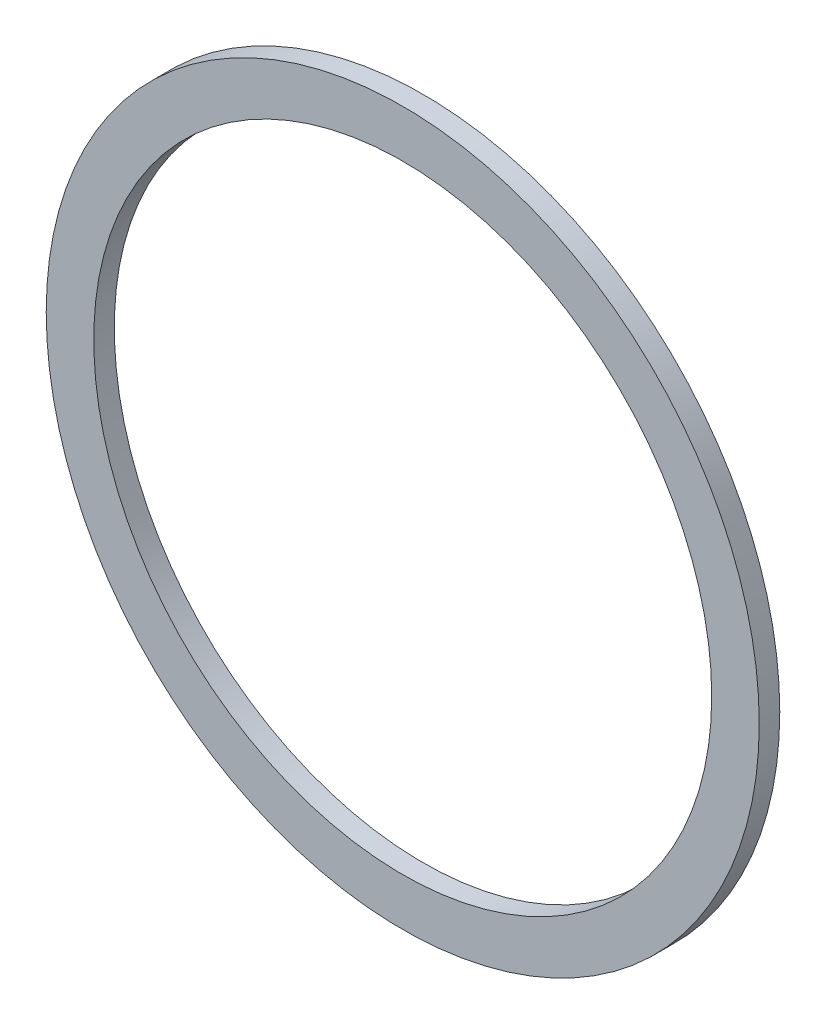
ISO-10303-21;
HEADER;
FILE_DESCRIPTION(('STEP AP214'),'2;1');
FILE_NAME('part.step','',(''),(''),'','','');
FILE_SCHEMA(('AUTOMOTIVE_DESIGN { 1 0 10303 214 1 1 1 1 }'));
ENDSEC;
DATA;
#1=APPLICATION_CONTEXT('core data for automotive mechanical design processes');
#2=APPLICATION_PROTOCOL_DEFINITION('international standard','automotive_design',2000,#1);
#3=PRODUCT_CONTEXT('',#1,'mechanical');
#4=PRODUCT('Part','Part','',(#3));
#5=PRODUCT_RELATED_PRODUCT_CATEGORY('part','',(#4));
#6=PRODUCT_DEFINITION_FORMATION('','',#4);
#7=PRODUCT_DEFINITION_CONTEXT('part definition',#1,'design');
#8=PRODUCT_DEFINITION('design','',#6,#7);
#9=PRODUCT_DEFINITION_SHAPE('','',#8);
#10=(LENGTH_UNIT() NAMED_UNIT(*) SI_UNIT(.MILLI.,.METRE.));
#11=(NAMED_UNIT(*) PLANE_ANGLE_UNIT() SI_UNIT($,.RADIAN.));
#12=(NAMED_UNIT(*) SI_UNIT($,.STERADIAN.) SOLID_ANGLE_UNIT());
#13=UNCERTAINTY_MEASURE_WITH_UNIT(LENGTH_MEASURE(1.E-05),#10,'distance_accuracy_value','');
#14=(GEOMETRIC_REPRESENTATION_CONTEXT(3) GLOBAL_UNCERTAINTY_ASSIGNED_CONTEXT((#13)) GLOBAL_UNIT_ASSIGNED_CONTEXT((#10,
#11,#12)) REPRESENTATION_CONTEXT('',''));
#15=CARTESIAN_POINT('',(0.,0.,0.));
#16=DIRECTION('',(0.,0.,1.));
#17=DIRECTION('',(1.,0.,0.));
#18=AXIS2_PLACEMENT_3D('',#15,#16,#17);
#19=CARTESIAN_POINT('',(0.,0.,4.318));
#20=DIRECTION('',(0.,0.,1.));
#21=DIRECTION('',(1.,0.,0.));
#22=AXIS2_PLACEMENT_3D('',#19,#20,#21);
#23=PLANE('',#22);
#24=CARTESIAN_POINT('',(0.,0.,4.318));
#25=DIRECTION('',(0.,0.,1.));
#26=DIRECTION('',(1.,0.,0.));
#27=AXIS2_PLACEMENT_3D('',#24,#25,#26);
#28=CIRCLE('',#27,75.);
#29=CARTESIAN_POINT('',(75.,0.,4.318));
#30=VERTEX_POINT('',#29);
#31=EDGE_CURVE('E10',#30,#30,#28,.T.);
#32=ORIENTED_EDGE('',*,*,#31,.T.);
#33=EDGE_LOOP('',(#32));
#34=FACE_BOUND('',#33,.T.);
#35=CARTESIAN_POINT('',(0.,0.,4.318));
#36=DIRECTION('',(0.,0.,1.));
#37=DIRECTION('',(1.,0.,0.));
#38=AXIS2_PLACEMENT_3D('',#35,#36,#37);
#39=CIRCLE('',#38,65.);
#40=CARTESIAN_POINT('',(65.,0.,4.318));
#41=VERTEX_POINT('',#40);
#42=EDGE_CURVE('E42',#41,#41,#39,.T.);
#43=ORIENTED_EDGE('',*,*,#42,.F.);
#44=EDGE_LOOP('',(#43));
#45=FACE_BOUND('',#44,.T.);
#46=ADVANCED_FACE('F31',(#34,#45),#23,.T.);
#47=CARTESIAN_POINT('',(0.,0.,0.));
#48=DIRECTION('',(0.,0.,1.));
#49=DIRECTION('',(1.,0.,0.));
#50=AXIS2_PLACEMENT_3D('',#47,#48,#49);
#51=PLANE('',#50);
#52=CARTESIAN_POINT('',(0.,0.,0.));
#53=DIRECTION('',(0.,0.,1.));
#54=DIRECTION('',(1.,0.,0.));
#55=AXIS2_PLACEMENT_3D('',#52,#53,#54);
#56=CIRCLE('',#55,75.);
#57=CARTESIAN_POINT('',(75.,0.,0.));
#58=VERTEX_POINT('',#57);
#59=EDGE_CURVE('E35',#58,#58,#56,.T.);
#60=ORIENTED_EDGE('',*,*,#59,.F.);
#61=EDGE_LOOP('',(#60));
#62=FACE_BOUND('',#61,.T.);
#63=CARTESIAN_POINT('',(0.,0.,0.));
#64=DIRECTION('',(0.,0.,1.));
#65=DIRECTION('',(1.,0.,0.));
#66=AXIS2_PLACEMENT_3D('',#63,#64,#65);
#67=CIRCLE('',#66,65.);
#68=CARTESIAN_POINT('',(65.,0.,0.));
#69=VERTEX_POINT('',#68);
#70=EDGE_CURVE('E44',#69,#69,#67,.T.);
#71=ORIENTED_EDGE('',*,*,#70,.T.);
#72=EDGE_LOOP('',(#71));
#73=FACE_BOUND('',#72,.T.);
#74=ADVANCED_FACE('F54',(#62,#73),#51,.F.);
#75=CARTESIAN_POINT('',(0.,0.,4.318));
#76=DIRECTION('',(0.,0.,-1.));
#77=DIRECTION('',(-1.,0.,0.));
#78=AXIS2_PLACEMENT_3D('',#75,#76,#77);
#79=CYLINDRICAL_SURFACE('',#78,75.);
#80=ORIENTED_EDGE('',*,*,#31,.F.);
#81=EDGE_LOOP('',(#80));
#82=FACE_BOUND('',#81,.T.);
#83=ORIENTED_EDGE('',*,*,#59,.T.);
#84=EDGE_LOOP('',(#83));
#85=FACE_BOUND('',#84,.T.);
#86=ADVANCED_FACE('F33',(#82,#85),#79,.T.);
#87=CARTESIAN_POINT('',(0.,0.,4.318));
#88=DIRECTION('',(0.,0.,-1.));
#89=DIRECTION('',(-1.,0.,0.));
#90=AXIS2_PLACEMENT_3D('',#87,#88,#89);
#91=CYLINDRICAL_SURFACE('',#90,65.);
#92=ORIENTED_EDGE('',*,*,#42,.T.);
#93=EDGE_LOOP('',(#92));
#94=FACE_BOUND('',#93,.T.);
#95=ORIENTED_EDGE('',*,*,#70,.F.);
#96=EDGE_LOOP('',(#95));
#97=FACE_BOUND('',#96,.T.);
#98=ADVANCED_FACE('F50',(#94,#97),#91,.F.);
#99=CLOSED_SHELL('',(#46,#74,#86,#98));
#100=MANIFOLD_SOLID_BREP('B2',#99);
#101=ADVANCED_BREP_SHAPE_REPRESENTATION('',(#18,#100),#14);
#102=SHAPE_DEFINITION_REPRESENTATION(#9,#101);
ENDSEC;
END-ISO-10303-21;
